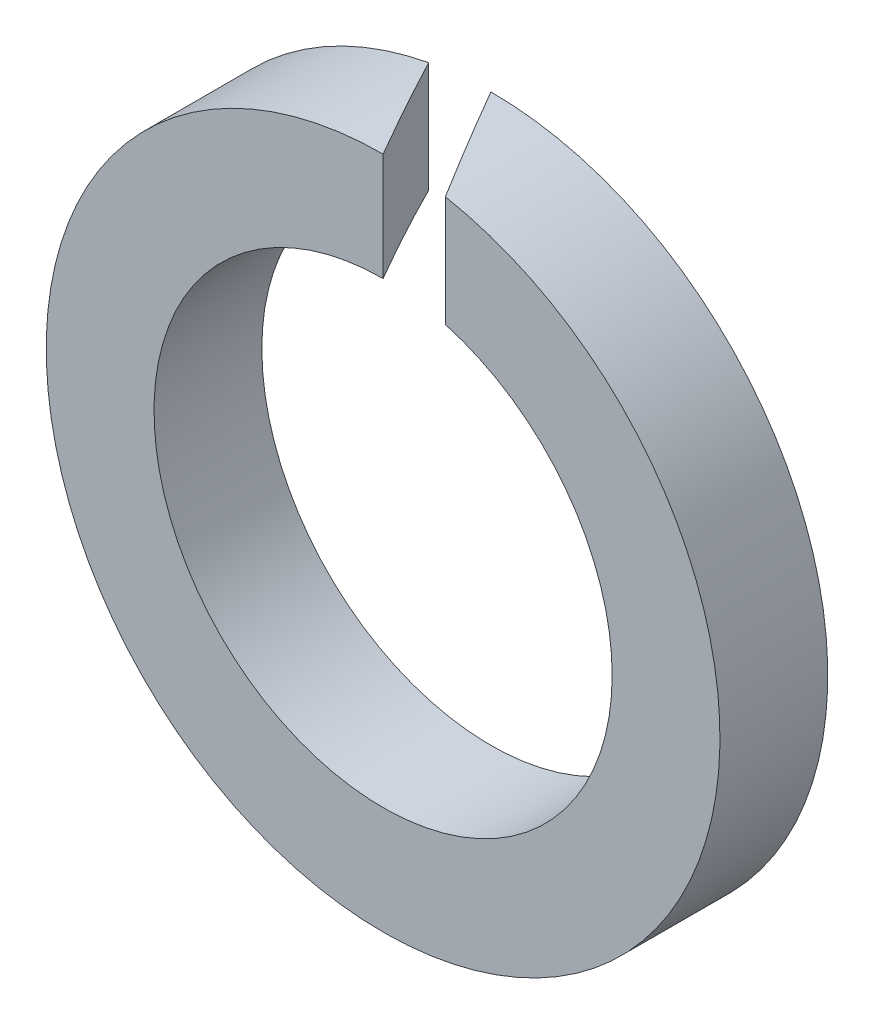
ISO-10303-21;
HEADER;
FILE_DESCRIPTION(('STEP AP214'),'2;1');
FILE_NAME('part.step','',(''),(''),'','','');
FILE_SCHEMA(('AUTOMOTIVE_DESIGN { 1 0 10303 214 1 1 1 1 }'));
ENDSEC;
DATA;
#1=APPLICATION_CONTEXT('core data for automotive mechanical design processes');
#2=APPLICATION_PROTOCOL_DEFINITION('international standard','automotive_design',2000,#1);
#3=PRODUCT_CONTEXT('',#1,'mechanical');
#4=PRODUCT('Part','Part','',(#3));
#5=PRODUCT_RELATED_PRODUCT_CATEGORY('part','',(#4));
#6=PRODUCT_DEFINITION_FORMATION('','',#4);
#7=PRODUCT_DEFINITION_CONTEXT('part definition',#1,'design');
#8=PRODUCT_DEFINITION('design','',#6,#7);
#9=PRODUCT_DEFINITION_SHAPE('','',#8);
#10=(LENGTH_UNIT() NAMED_UNIT(*) SI_UNIT(.MILLI.,.METRE.));
#11=(NAMED_UNIT(*) PLANE_ANGLE_UNIT() SI_UNIT($,.RADIAN.));
#12=(NAMED_UNIT(*) SI_UNIT($,.STERADIAN.) SOLID_ANGLE_UNIT());
#13=UNCERTAINTY_MEASURE_WITH_UNIT(LENGTH_MEASURE(1.E-05),#10,'distance_accuracy_value','');
#14=(GEOMETRIC_REPRESENTATION_CONTEXT(3) GLOBAL_UNCERTAINTY_ASSIGNED_CONTEXT((#13)) GLOBAL_UNIT_ASSIGNED_CONTEXT((#10,
#11,#12)) REPRESENTATION_CONTEXT('',''));
#15=CARTESIAN_POINT('',(0.,0.,0.));
#16=DIRECTION('',(0.,0.,1.));
#17=DIRECTION('',(1.,0.,0.));
#18=AXIS2_PLACEMENT_3D('',#15,#16,#17);
#19=CARTESIAN_POINT('',(0.,0.,-0.8));
#20=DIRECTION('',(0.,0.,1.));
#21=DIRECTION('',(1.,0.,0.));
#22=AXIS2_PLACEMENT_3D('',#19,#20,#21);
#23=CYLINDRICAL_SURFACE('',#22,2.5);
#24=CARTESIAN_POINT('',(0.,0.,0.));
#25=DIRECTION('',(0.,0.,1.));
#26=DIRECTION('',(1.,0.,0.));
#27=AXIS2_PLACEMENT_3D('',#24,#25,#26);
#28=CIRCLE('',#27,2.5);
#29=CARTESIAN_POINT('',(0.,2.5,0.));
#30=VERTEX_POINT('',#29);
#31=CARTESIAN_POINT('',(0.461880215351701,2.45696289484938,0.));
#32=VERTEX_POINT('',#31);
#33=EDGE_CURVE('E89',#30,#32,#28,.T.);
#34=ORIENTED_EDGE('',*,*,#33,.F.);
#35=CARTESIAN_POINT('',(0.,0.,0.));
#36=DIRECTION('',(0.866025403784438,0.,-0.5));
#37=DIRECTION('',(0.5,0.,0.866025403784439));
#38=AXIS2_PLACEMENT_3D('',#35,#36,#37);
#39=ELLIPSE('',#38,5.,2.5);
#40=CARTESIAN_POINT('',(-0.461880215351701,2.45696289484938,-0.8));
#41=VERTEX_POINT('',#40);
#42=EDGE_CURVE('E73',#30,#41,#39,.F.);
#43=ORIENTED_EDGE('',*,*,#42,.T.);
#44=CARTESIAN_POINT('',(0.,0.,-0.8));
#45=DIRECTION('',(0.,0.,1.));
#46=DIRECTION('',(1.,0.,0.));
#47=AXIS2_PLACEMENT_3D('',#44,#45,#46);
#48=CIRCLE('',#47,2.5);
#49=CARTESIAN_POINT('',(0.,2.5,-0.8));
#50=VERTEX_POINT('',#49);
#51=EDGE_CURVE('E94',#41,#50,#48,.T.);
#52=ORIENTED_EDGE('',*,*,#51,.T.);
#53=CARTESIAN_POINT('',(0.,0.,-0.8));
#54=DIRECTION('',(-0.866025403784438,0.,0.5));
#55=DIRECTION('',(0.5,0.,0.866025403784439));
#56=AXIS2_PLACEMENT_3D('',#53,#54,#55);
#57=ELLIPSE('',#56,5.,2.5);
#58=EDGE_CURVE('E82',#50,#32,#57,.F.);
#59=ORIENTED_EDGE('',*,*,#58,.T.);
#60=EDGE_LOOP('',(#34,#43,#52,#59));
#61=FACE_BOUND('',#60,.T.);
#62=ADVANCED_FACE('F36',(#61),#23,.T.);
#63=CARTESIAN_POINT('',(0.,0.,-0.8));
#64=DIRECTION('',(0.,0.,1.));
#65=DIRECTION('',(1.,0.,0.));
#66=AXIS2_PLACEMENT_3D('',#63,#64,#65);
#67=PLANE('',#66);
#68=DIRECTION('',(0.,-1.,0.));
#69=VECTOR('',#68,1.);
#70=CARTESIAN_POINT('',(-0.461880215351701,2.5,-0.8));
#71=LINE('',#70,#69);
#72=CARTESIAN_POINT('',(-0.461880215351701,1.63605215890774,-0.8));
#73=VERTEX_POINT('',#72);
#74=EDGE_CURVE('E76',#41,#73,#71,.T.);
#75=ORIENTED_EDGE('',*,*,#74,.T.);
#76=CARTESIAN_POINT('',(0.,0.,-0.8));
#77=DIRECTION('',(0.,0.,1.));
#78=DIRECTION('',(1.,0.,0.));
#79=AXIS2_PLACEMENT_3D('',#76,#77,#78);
#80=CIRCLE('',#79,1.7);
#81=CARTESIAN_POINT('',(0.,1.7,-0.8));
#82=VERTEX_POINT('',#81);
#83=EDGE_CURVE('E95',#73,#82,#80,.T.);
#84=ORIENTED_EDGE('',*,*,#83,.T.);
#85=DIRECTION('',(0.,-1.,0.));
#86=VECTOR('',#85,1.);
#87=CARTESIAN_POINT('',(0.,2.5,-0.8));
#88=LINE('',#87,#86);
#89=EDGE_CURVE('E57',#50,#82,#88,.T.);
#90=ORIENTED_EDGE('',*,*,#89,.F.);
#91=ORIENTED_EDGE('',*,*,#51,.F.);
#92=EDGE_LOOP('',(#75,#84,#90,#91));
#93=FACE_BOUND('',#92,.T.);
#94=ADVANCED_FACE('F110',(#93),#67,.F.);
#95=CARTESIAN_POINT('',(0.,0.,0.));
#96=DIRECTION('',(0.,0.,1.));
#97=DIRECTION('',(1.,0.,0.));
#98=AXIS2_PLACEMENT_3D('',#95,#96,#97);
#99=PLANE('',#98);
#100=CARTESIAN_POINT('',(0.,0.,0.));
#101=DIRECTION('',(0.,0.,1.));
#102=DIRECTION('',(1.,0.,0.));
#103=AXIS2_PLACEMENT_3D('',#100,#101,#102);
#104=CIRCLE('',#103,1.7);
#105=CARTESIAN_POINT('',(0.,1.7,0.));
#106=VERTEX_POINT('',#105);
#107=CARTESIAN_POINT('',(0.461880215351701,1.63605215890774,0.));
#108=VERTEX_POINT('',#107);
#109=EDGE_CURVE('E81',#106,#108,#104,.T.);
#110=ORIENTED_EDGE('',*,*,#109,.F.);
#111=DIRECTION('',(0.,-1.,0.));
#112=VECTOR('',#111,1.);
#113=CARTESIAN_POINT('',(0.,2.5,0.));
#114=LINE('',#113,#112);
#115=EDGE_CURVE('E49',#30,#106,#114,.T.);
#116=ORIENTED_EDGE('',*,*,#115,.F.);
#117=ORIENTED_EDGE('',*,*,#33,.T.);
#118=DIRECTION('',(0.,-1.,0.));
#119=VECTOR('',#118,1.);
#120=CARTESIAN_POINT('',(0.461880215351701,2.5,0.));
#121=LINE('',#120,#119);
#122=EDGE_CURVE('E91',#32,#108,#121,.T.);
#123=ORIENTED_EDGE('',*,*,#122,.T.);
#124=EDGE_LOOP('',(#110,#116,#117,#123));
#125=FACE_BOUND('',#124,.T.);
#126=ADVANCED_FACE('F87',(#125),#99,.T.);
#127=CARTESIAN_POINT('',(0.,0.,-0.8));
#128=DIRECTION('',(0.,0.,1.));
#129=DIRECTION('',(1.,0.,0.));
#130=AXIS2_PLACEMENT_3D('',#127,#128,#129);
#131=CYLINDRICAL_SURFACE('',#130,1.7);
#132=CARTESIAN_POINT('',(0.,0.,0.));
#133=DIRECTION('',(0.866025403784438,0.,-0.5));
#134=DIRECTION('',(0.5,0.,0.866025403784439));
#135=AXIS2_PLACEMENT_3D('',#132,#133,#134);
#136=ELLIPSE('',#135,3.4,1.7);
#137=EDGE_CURVE('E11',#106,#73,#136,.F.);
#138=ORIENTED_EDGE('',*,*,#137,.F.);
#139=ORIENTED_EDGE('',*,*,#109,.T.);
#140=CARTESIAN_POINT('',(0.,0.,-0.8));
#141=DIRECTION('',(-0.866025403784438,0.,0.5));
#142=DIRECTION('',(0.5,0.,0.866025403784439));
#143=AXIS2_PLACEMENT_3D('',#140,#141,#142);
#144=ELLIPSE('',#143,3.4,1.7);
#145=EDGE_CURVE('E43',#82,#108,#144,.F.);
#146=ORIENTED_EDGE('',*,*,#145,.F.);
#147=ORIENTED_EDGE('',*,*,#83,.F.);
#148=EDGE_LOOP('',(#138,#139,#146,#147));
#149=FACE_BOUND('',#148,.T.);
#150=ADVANCED_FACE('F105',(#149),#131,.F.);
#151=CARTESIAN_POINT('',(0.,2.5,-0.8));
#152=DIRECTION('',(-0.866025403784438,0.,0.5));
#153=DIRECTION('',(0.5,0.,0.866025403784439));
#154=AXIS2_PLACEMENT_3D('',#151,#152,#153);
#155=PLANE('',#154);
#156=ORIENTED_EDGE('',*,*,#89,.T.);
#157=ORIENTED_EDGE('',*,*,#145,.T.);
#158=ORIENTED_EDGE('',*,*,#122,.F.);
#159=ORIENTED_EDGE('',*,*,#58,.F.);
#160=EDGE_LOOP('',(#156,#157,#158,#159));
#161=FACE_BOUND('',#160,.T.);
#162=ADVANCED_FACE('F101',(#161),#155,.T.);
#163=CARTESIAN_POINT('',(0.,2.5,0.));
#164=DIRECTION('',(0.866025403784438,0.,-0.5));
#165=DIRECTION('',(-0.5,0.,-0.866025403784439));
#166=AXIS2_PLACEMENT_3D('',#163,#164,#165);
#167=PLANE('',#166);
#168=ORIENTED_EDGE('',*,*,#115,.T.);
#169=ORIENTED_EDGE('',*,*,#137,.T.);
#170=ORIENTED_EDGE('',*,*,#74,.F.);
#171=ORIENTED_EDGE('',*,*,#42,.F.);
#172=EDGE_LOOP('',(#168,#169,#170,#171));
#173=FACE_BOUND('',#172,.T.);
#174=ADVANCED_FACE('F74',(#173),#167,.T.);
#175=CLOSED_SHELL('',(#62,#94,#126,#150,#162,#174));
#176=MANIFOLD_SOLID_BREP('B2',#175);
#177=ADVANCED_BREP_SHAPE_REPRESENTATION('',(#18,#176),#14);
#178=SHAPE_DEFINITION_REPRESENTATION(#9,#177);
ENDSEC;
END-ISO-10303-21;
